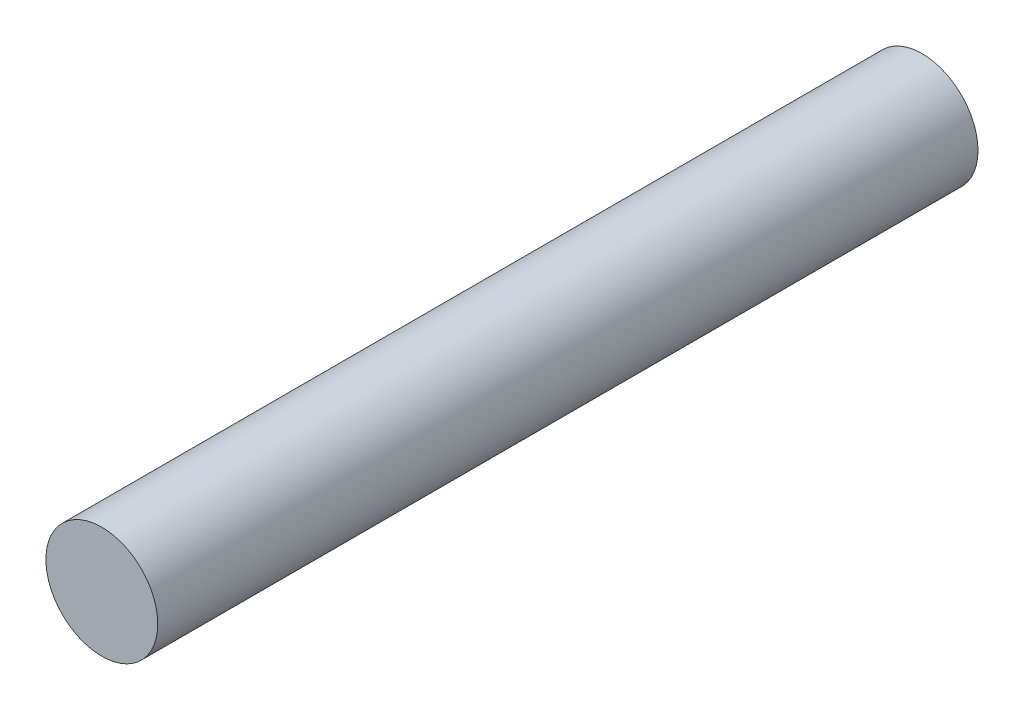
ISO-10303-21;
HEADER;
FILE_DESCRIPTION(('STEP AP214'),'2;1');
FILE_NAME('part.step','',(''),(''),'','','');
FILE_SCHEMA(('AUTOMOTIVE_DESIGN { 1 0 10303 214 1 1 1 1 }'));
ENDSEC;
DATA;
#1=APPLICATION_CONTEXT('core data for automotive mechanical design processes');
#2=APPLICATION_PROTOCOL_DEFINITION('international standard','automotive_design',2000,#1);
#3=PRODUCT_CONTEXT('',#1,'mechanical');
#4=PRODUCT('Part','Part','',(#3));
#5=PRODUCT_RELATED_PRODUCT_CATEGORY('part','',(#4));
#6=PRODUCT_DEFINITION_FORMATION('','',#4);
#7=PRODUCT_DEFINITION_CONTEXT('part definition',#1,'design');
#8=PRODUCT_DEFINITION('design','',#6,#7);
#9=PRODUCT_DEFINITION_SHAPE('','',#8);
#10=(LENGTH_UNIT() NAMED_UNIT(*) SI_UNIT(.MILLI.,.METRE.));
#11=(NAMED_UNIT(*) PLANE_ANGLE_UNIT() SI_UNIT($,.RADIAN.));
#12=(NAMED_UNIT(*) SI_UNIT($,.STERADIAN.) SOLID_ANGLE_UNIT());
#13=UNCERTAINTY_MEASURE_WITH_UNIT(LENGTH_MEASURE(1.E-05),#10,'distance_accuracy_value','');
#14=(GEOMETRIC_REPRESENTATION_CONTEXT(3) GLOBAL_UNCERTAINTY_ASSIGNED_CONTEXT((#13)) GLOBAL_UNIT_ASSIGNED_CONTEXT((#10,
#11,#12)) REPRESENTATION_CONTEXT('',''));
#15=CARTESIAN_POINT('',(0.,0.,0.));
#16=DIRECTION('',(0.,0.,1.));
#17=DIRECTION('',(1.,0.,0.));
#18=AXIS2_PLACEMENT_3D('',#15,#16,#17);
#19=CARTESIAN_POINT('',(0.,0.,22.));
#20=DIRECTION('',(0.,0.,-1.));
#21=DIRECTION('',(-1.,0.,0.));
#22=AXIS2_PLACEMENT_3D('',#19,#20,#21);
#23=CYLINDRICAL_SURFACE('',#22,1.5);
#24=CARTESIAN_POINT('',(0.,0.,22.));
#25=DIRECTION('',(0.,0.,1.));
#26=DIRECTION('',(1.,0.,0.));
#27=AXIS2_PLACEMENT_3D('',#24,#25,#26);
#28=CIRCLE('',#27,1.5);
#29=CARTESIAN_POINT('',(1.5,0.,22.));
#30=VERTEX_POINT('',#29);
#31=EDGE_CURVE('E10',#30,#30,#28,.T.);
#32=ORIENTED_EDGE('',*,*,#31,.F.);
#33=EDGE_LOOP('',(#32));
#34=FACE_BOUND('',#33,.T.);
#35=CARTESIAN_POINT('',(0.,0.,0.));
#36=DIRECTION('',(0.,0.,1.));
#37=DIRECTION('',(1.,0.,0.));
#38=AXIS2_PLACEMENT_3D('',#35,#36,#37);
#39=CIRCLE('',#38,1.5);
#40=CARTESIAN_POINT('',(1.5,0.,0.));
#41=VERTEX_POINT('',#40);
#42=EDGE_CURVE('E36',#41,#41,#39,.T.);
#43=ORIENTED_EDGE('',*,*,#42,.T.);
#44=EDGE_LOOP('',(#43));
#45=FACE_BOUND('',#44,.T.);
#46=ADVANCED_FACE('F33',(#34,#45),#23,.T.);
#47=CARTESIAN_POINT('',(0.,0.,22.));
#48=DIRECTION('',(0.,0.,1.));
#49=DIRECTION('',(1.,0.,0.));
#50=AXIS2_PLACEMENT_3D('',#47,#48,#49);
#51=PLANE('',#50);
#52=ORIENTED_EDGE('',*,*,#31,.T.);
#53=EDGE_LOOP('',(#52));
#54=FACE_BOUND('',#53,.T.);
#55=ADVANCED_FACE('F48',(#54),#51,.T.);
#56=CARTESIAN_POINT('',(0.,0.,0.));
#57=DIRECTION('',(0.,0.,1.));
#58=DIRECTION('',(1.,0.,0.));
#59=AXIS2_PLACEMENT_3D('',#56,#57,#58);
#60=PLANE('',#59);
#61=ORIENTED_EDGE('',*,*,#42,.F.);
#62=EDGE_LOOP('',(#61));
#63=FACE_BOUND('',#62,.T.);
#64=ADVANCED_FACE('F46',(#63),#60,.F.);
#65=CLOSED_SHELL('',(#46,#55,#64));
#66=MANIFOLD_SOLID_BREP('B2',#65);
#67=ADVANCED_BREP_SHAPE_REPRESENTATION('',(#18,#66),#14);
#68=SHAPE_DEFINITION_REPRESENTATION(#9,#67);
ENDSEC;
END-ISO-10303-21;
